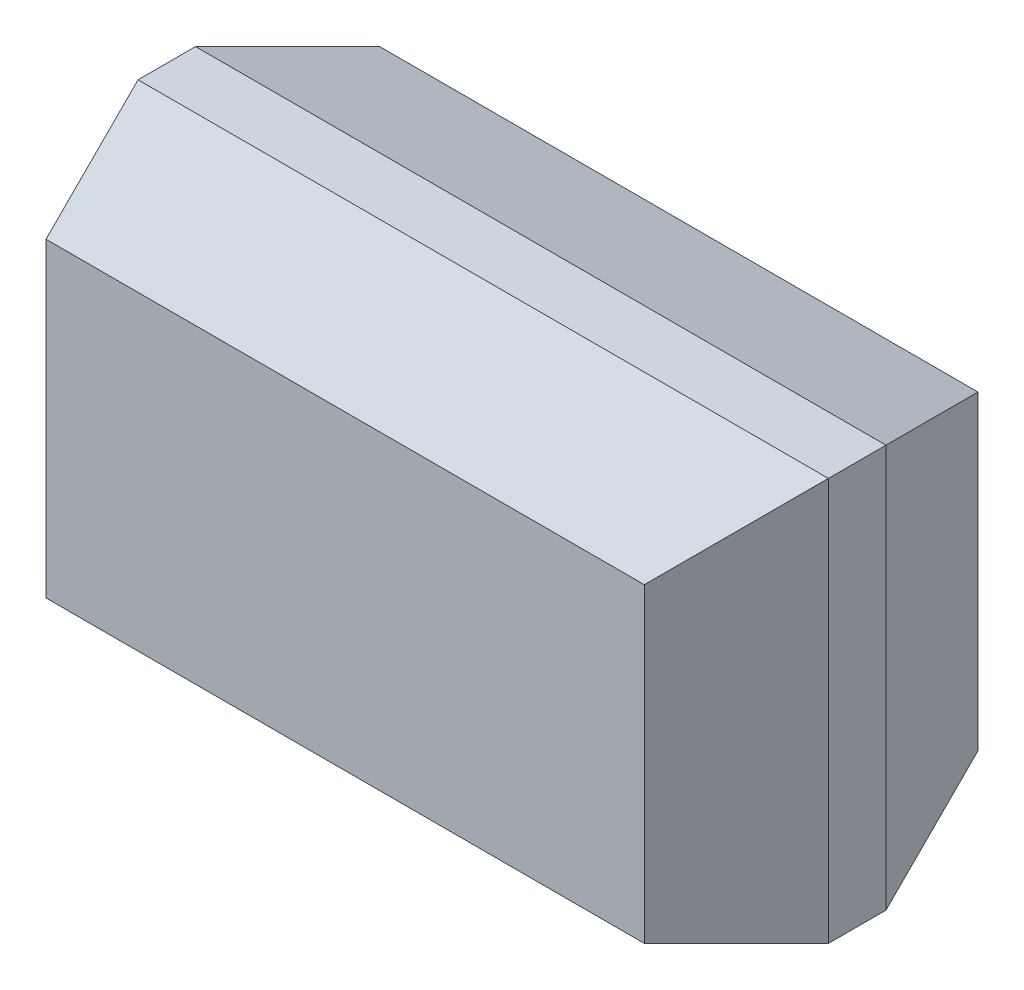
ISO-10303-21;
HEADER;
FILE_DESCRIPTION(('STEP AP214'),'2;1');
FILE_NAME('part.step','',(''),(''),'','','');
FILE_SCHEMA(('AUTOMOTIVE_DESIGN { 1 0 10303 214 1 1 1 1 }'));
ENDSEC;
DATA;
#1=APPLICATION_CONTEXT('core data for automotive mechanical design processes');
#2=APPLICATION_PROTOCOL_DEFINITION('international standard','automotive_design',2000,#1);
#3=PRODUCT_CONTEXT('',#1,'mechanical');
#4=PRODUCT('Part','Part','',(#3));
#5=PRODUCT_RELATED_PRODUCT_CATEGORY('part','',(#4));
#6=PRODUCT_DEFINITION_FORMATION('','',#4);
#7=PRODUCT_DEFINITION_CONTEXT('part definition',#1,'design');
#8=PRODUCT_DEFINITION('design','',#6,#7);
#9=PRODUCT_DEFINITION_SHAPE('','',#8);
#10=(LENGTH_UNIT() NAMED_UNIT(*) SI_UNIT(.MILLI.,.METRE.));
#11=(NAMED_UNIT(*) PLANE_ANGLE_UNIT() SI_UNIT($,.RADIAN.));
#12=(NAMED_UNIT(*) SI_UNIT($,.STERADIAN.) SOLID_ANGLE_UNIT());
#13=UNCERTAINTY_MEASURE_WITH_UNIT(LENGTH_MEASURE(1.E-05),#10,'distance_accuracy_value','');
#14=(GEOMETRIC_REPRESENTATION_CONTEXT(3) GLOBAL_UNCERTAINTY_ASSIGNED_CONTEXT((#13)) GLOBAL_UNIT_ASSIGNED_CONTEXT((#10,
#11,#12)) REPRESENTATION_CONTEXT('',''));
#15=CARTESIAN_POINT('',(0.,0.,0.));
#16=DIRECTION('',(0.,0.,1.));
#17=DIRECTION('',(1.,0.,0.));
#18=AXIS2_PLACEMENT_3D('',#15,#16,#17);
#19=CARTESIAN_POINT('',(0.,0.,1.45));
#20=DIRECTION('',(1.,0.,0.));
#21=DIRECTION('',(0.,0.,-1.));
#22=AXIS2_PLACEMENT_3D('',#19,#20,#21);
#23=PLANE('',#22);
#24=DIRECTION('',(0.,0.,-1.));
#25=VECTOR('',#24,1.);
#26=CARTESIAN_POINT('',(0.,1.75,1.45));
#27=LINE('',#26,#25);
#28=CARTESIAN_POINT('',(0.,1.75,0.849999999999994));
#29=VERTEX_POINT('',#28);
#30=CARTESIAN_POINT('',(0.,1.75,0.600000000000008));
#31=VERTEX_POINT('',#30);
#32=EDGE_CURVE('E173',#29,#31,#27,.T.);
#33=ORIENTED_EDGE('',*,*,#32,.T.);
#34=DIRECTION('',(0.,-1.,0.));
#35=VECTOR('',#34,1.);
#36=CARTESIAN_POINT('',(0.,0.2,0.600000000000007));
#37=LINE('',#36,#35);
#38=CARTESIAN_POINT('',(0.,0.,0.600000000000008));
#39=VERTEX_POINT('',#38);
#40=EDGE_CURVE('E145',#31,#39,#37,.T.);
#41=ORIENTED_EDGE('',*,*,#40,.T.);
#42=DIRECTION('',(0.,0.,-1.));
#43=VECTOR('',#42,1.);
#44=CARTESIAN_POINT('',(0.,0.,1.45));
#45=LINE('',#44,#43);
#46=CARTESIAN_POINT('',(0.,0.,0.849999999999994));
#47=VERTEX_POINT('',#46);
#48=EDGE_CURVE('E118',#47,#39,#45,.T.);
#49=ORIENTED_EDGE('',*,*,#48,.F.);
#50=DIRECTION('',(0.,1.,0.));
#51=VECTOR('',#50,1.);
#52=CARTESIAN_POINT('',(0.,0.,0.849999999999994));
#53=LINE('',#52,#51);
#54=EDGE_CURVE('E151',#47,#29,#53,.T.);
#55=ORIENTED_EDGE('',*,*,#54,.T.);
#56=EDGE_LOOP('',(#33,#41,#49,#55));
#57=FACE_BOUND('',#56,.T.);
#58=ADVANCED_FACE('F30',(#57),#23,.F.);
#59=CARTESIAN_POINT('',(0.,0.,1.45));
#60=DIRECTION('',(0.,1.,0.));
#61=DIRECTION('',(0.,0.,1.));
#62=AXIS2_PLACEMENT_3D('',#59,#60,#61);
#63=PLANE('',#62);
#64=ORIENTED_EDGE('',*,*,#48,.T.);
#65=DIRECTION('',(1.,0.,0.));
#66=VECTOR('',#65,1.);
#67=CARTESIAN_POINT('',(3.,0.,0.600000000000007));
#68=LINE('',#67,#66);
#69=CARTESIAN_POINT('',(3.,0.,0.600000000000008));
#70=VERTEX_POINT('',#69);
#71=EDGE_CURVE('E117',#39,#70,#68,.T.);
#72=ORIENTED_EDGE('',*,*,#71,.T.);
#73=DIRECTION('',(0.,0.,-1.));
#74=VECTOR('',#73,1.);
#75=CARTESIAN_POINT('',(3.,0.,1.45));
#76=LINE('',#75,#74);
#77=CARTESIAN_POINT('',(3.,0.,0.849999999999994));
#78=VERTEX_POINT('',#77);
#79=EDGE_CURVE('E99',#78,#70,#76,.T.);
#80=ORIENTED_EDGE('',*,*,#79,.F.);
#81=DIRECTION('',(-1.,0.,0.));
#82=VECTOR('',#81,1.);
#83=CARTESIAN_POINT('',(0.,0.,0.849999999999994));
#84=LINE('',#83,#82);
#85=EDGE_CURVE('E114',#78,#47,#84,.T.);
#86=ORIENTED_EDGE('',*,*,#85,.T.);
#87=EDGE_LOOP('',(#64,#72,#80,#86));
#88=FACE_BOUND('',#87,.T.);
#89=ADVANCED_FACE('F113',(#88),#63,.F.);
#90=CARTESIAN_POINT('',(3.,0.,1.45));
#91=DIRECTION('',(-1.,0.,0.));
#92=DIRECTION('',(0.,0.,1.));
#93=AXIS2_PLACEMENT_3D('',#90,#91,#92);
#94=PLANE('',#93);
#95=ORIENTED_EDGE('',*,*,#79,.T.);
#96=DIRECTION('',(0.,1.,0.));
#97=VECTOR('',#96,1.);
#98=CARTESIAN_POINT('',(3.,1.55,0.600000000000007));
#99=LINE('',#98,#97);
#100=CARTESIAN_POINT('',(3.,1.75,0.600000000000008));
#101=VERTEX_POINT('',#100);
#102=EDGE_CURVE('E131',#70,#101,#99,.T.);
#103=ORIENTED_EDGE('',*,*,#102,.T.);
#104=DIRECTION('',(0.,0.,-1.));
#105=VECTOR('',#104,1.);
#106=CARTESIAN_POINT('',(3.,1.75,1.45));
#107=LINE('',#106,#105);
#108=CARTESIAN_POINT('',(3.,1.75,0.849999999999994));
#109=VERTEX_POINT('',#108);
#110=EDGE_CURVE('E102',#109,#101,#107,.T.);
#111=ORIENTED_EDGE('',*,*,#110,.F.);
#112=DIRECTION('',(0.,-1.,0.));
#113=VECTOR('',#112,1.);
#114=CARTESIAN_POINT('',(3.,0.,0.849999999999993));
#115=LINE('',#114,#113);
#116=EDGE_CURVE('E95',#109,#78,#115,.T.);
#117=ORIENTED_EDGE('',*,*,#116,.T.);
#118=EDGE_LOOP('',(#95,#103,#111,#117));
#119=FACE_BOUND('',#118,.T.);
#120=ADVANCED_FACE('F97',(#119),#94,.F.);
#121=CARTESIAN_POINT('',(0.,1.75,1.45));
#122=DIRECTION('',(0.,-1.,0.));
#123=DIRECTION('',(0.,0.,-1.));
#124=AXIS2_PLACEMENT_3D('',#121,#122,#123);
#125=PLANE('',#124);
#126=ORIENTED_EDGE('',*,*,#110,.T.);
#127=DIRECTION('',(-1.,0.,0.));
#128=VECTOR('',#127,1.);
#129=CARTESIAN_POINT('',(0.,1.75,0.600000000000007));
#130=LINE('',#129,#128);
#131=EDGE_CURVE('E159',#101,#31,#130,.T.);
#132=ORIENTED_EDGE('',*,*,#131,.T.);
#133=ORIENTED_EDGE('',*,*,#32,.F.);
#134=DIRECTION('',(1.,0.,0.));
#135=VECTOR('',#134,1.);
#136=CARTESIAN_POINT('',(0.,1.75,0.849999999999994));
#137=LINE('',#136,#135);
#138=EDGE_CURVE('E162',#29,#109,#137,.T.);
#139=ORIENTED_EDGE('',*,*,#138,.T.);
#140=EDGE_LOOP('',(#126,#132,#133,#139));
#141=FACE_BOUND('',#140,.T.);
#142=ADVANCED_FACE('F189',(#141),#125,.F.);
#143=CARTESIAN_POINT('',(0.,1.75,1.45));
#144=DIRECTION('',(0.,0.,-1.));
#145=DIRECTION('',(-1.,0.,0.));
#146=AXIS2_PLACEMENT_3D('',#143,#144,#145);
#147=PLANE('',#146);
#148=DIRECTION('',(1.,0.,0.));
#149=VECTOR('',#148,1.);
#150=CARTESIAN_POINT('',(0.,0.2,1.45));
#151=LINE('',#150,#149);
#152=CARTESIAN_POINT('',(0.2,0.2,1.45));
#153=VERTEX_POINT('',#152);
#154=CARTESIAN_POINT('',(2.8,0.2,1.45));
#155=VERTEX_POINT('',#154);
#156=EDGE_CURVE('E125',#153,#155,#151,.T.);
#157=ORIENTED_EDGE('',*,*,#156,.T.);
#158=DIRECTION('',(0.,1.,0.));
#159=VECTOR('',#158,1.);
#160=CARTESIAN_POINT('',(2.8,1.75,1.45));
#161=LINE('',#160,#159);
#162=CARTESIAN_POINT('',(2.8,1.55,1.45));
#163=VERTEX_POINT('',#162);
#164=EDGE_CURVE('E130',#155,#163,#161,.T.);
#165=ORIENTED_EDGE('',*,*,#164,.T.);
#166=DIRECTION('',(-1.,0.,0.));
#167=VECTOR('',#166,1.);
#168=CARTESIAN_POINT('',(0.,1.55,1.45));
#169=LINE('',#168,#167);
#170=CARTESIAN_POINT('',(0.2,1.55,1.45));
#171=VERTEX_POINT('',#170);
#172=EDGE_CURVE('E165',#163,#171,#169,.T.);
#173=ORIENTED_EDGE('',*,*,#172,.T.);
#174=DIRECTION('',(0.,-1.,0.));
#175=VECTOR('',#174,1.);
#176=CARTESIAN_POINT('',(0.2,1.75,1.45));
#177=LINE('',#176,#175);
#178=EDGE_CURVE('E154',#171,#153,#177,.T.);
#179=ORIENTED_EDGE('',*,*,#178,.T.);
#180=EDGE_LOOP('',(#157,#165,#173,#179));
#181=FACE_BOUND('',#180,.T.);
#182=ADVANCED_FACE('F193',(#181),#147,.F.);
#183=CARTESIAN_POINT('',(0.,1.75,0.));
#184=DIRECTION('',(0.,0.,-1.));
#185=DIRECTION('',(-1.,0.,0.));
#186=AXIS2_PLACEMENT_3D('',#183,#184,#185);
#187=PLANE('',#186);
#188=DIRECTION('',(1.,0.,0.));
#189=VECTOR('',#188,1.);
#190=CARTESIAN_POINT('',(3.,1.55,0.));
#191=LINE('',#190,#189);
#192=CARTESIAN_POINT('',(0.2,1.55,0.));
#193=VERTEX_POINT('',#192);
#194=CARTESIAN_POINT('',(2.8,1.55,0.));
#195=VERTEX_POINT('',#194);
#196=EDGE_CURVE('E157',#193,#195,#191,.T.);
#197=ORIENTED_EDGE('',*,*,#196,.T.);
#198=DIRECTION('',(0.,-1.,0.));
#199=VECTOR('',#198,1.);
#200=CARTESIAN_POINT('',(2.8,0.2,0.));
#201=LINE('',#200,#199);
#202=CARTESIAN_POINT('',(2.8,0.2,0.));
#203=VERTEX_POINT('',#202);
#204=EDGE_CURVE('E38',#195,#203,#201,.T.);
#205=ORIENTED_EDGE('',*,*,#204,.T.);
#206=DIRECTION('',(-1.,0.,0.));
#207=VECTOR('',#206,1.);
#208=CARTESIAN_POINT('',(0.,0.2,0.));
#209=LINE('',#208,#207);
#210=CARTESIAN_POINT('',(0.2,0.2,0.));
#211=VERTEX_POINT('',#210);
#212=EDGE_CURVE('E167',#203,#211,#209,.T.);
#213=ORIENTED_EDGE('',*,*,#212,.T.);
#214=DIRECTION('',(0.,1.,0.));
#215=VECTOR('',#214,1.);
#216=CARTESIAN_POINT('',(0.2,1.55,0.));
#217=LINE('',#216,#215);
#218=EDGE_CURVE('E140',#211,#193,#217,.T.);
#219=ORIENTED_EDGE('',*,*,#218,.T.);
#220=EDGE_LOOP('',(#197,#205,#213,#219));
#221=FACE_BOUND('',#220,.T.);
#222=ADVANCED_FACE('F191',(#221),#187,.T.);
#223=CARTESIAN_POINT('',(0.,0.2,1.45));
#224=DIRECTION('',(0.,0.948683298050515,-0.316227766016835));
#225=DIRECTION('',(0.,0.316227766016835,0.948683298050515));
#226=AXIS2_PLACEMENT_3D('',#223,#224,#225);
#227=PLANE('',#226);
#228=ORIENTED_EDGE('',*,*,#85,.F.);
#229=DIRECTION('',(-0.301511344577761,0.301511344577761,0.904534033733292));
#230=VECTOR('',#229,1.);
#231=CARTESIAN_POINT('',(2.54545454545455,0.454545454545451,2.21363636363636));
#232=LINE('',#231,#230);
#233=EDGE_CURVE('E105',#78,#155,#232,.T.);
#234=ORIENTED_EDGE('',*,*,#233,.T.);
#235=ORIENTED_EDGE('',*,*,#156,.F.);
#236=DIRECTION('',(-0.301511344577761,-0.301511344577761,-0.904534033733292));
#237=VECTOR('',#236,1.);
#238=CARTESIAN_POINT('',(0.181818181818182,0.181818181818182,1.39545454545455));
#239=LINE('',#238,#237);
#240=EDGE_CURVE('E124',#153,#47,#239,.T.);
#241=ORIENTED_EDGE('',*,*,#240,.T.);
#242=EDGE_LOOP('',(#228,#234,#235,#241));
#243=FACE_BOUND('',#242,.T.);
#244=ADVANCED_FACE('F121',(#243),#227,.F.);
#245=CARTESIAN_POINT('',(0.,0.,0.600000000000007));
#246=DIRECTION('',(0.,-0.948683298050515,-0.316227766016835));
#247=DIRECTION('',(0.,0.316227766016835,-0.948683298050515));
#248=AXIS2_PLACEMENT_3D('',#245,#246,#247);
#249=PLANE('',#248);
#250=ORIENTED_EDGE('',*,*,#212,.F.);
#251=DIRECTION('',(0.301511344577761,-0.301511344577761,0.904534033733292));
#252=VECTOR('',#251,1.);
#253=CARTESIAN_POINT('',(2.72727272727273,0.272727272727269,-0.218181818181807));
#254=LINE('',#253,#252);
#255=EDGE_CURVE('E11',#203,#70,#254,.T.);
#256=ORIENTED_EDGE('',*,*,#255,.T.);
#257=ORIENTED_EDGE('',*,*,#71,.F.);
#258=DIRECTION('',(0.301511344577761,0.301511344577761,-0.904534033733292));
#259=VECTOR('',#258,1.);
#260=CARTESIAN_POINT('',(0.,0.,0.600000000000007));
#261=LINE('',#260,#259);
#262=EDGE_CURVE('E142',#39,#211,#261,.T.);
#263=ORIENTED_EDGE('',*,*,#262,.T.);
#264=EDGE_LOOP('',(#250,#256,#257,#263));
#265=FACE_BOUND('',#264,.T.);
#266=ADVANCED_FACE('F186',(#265),#249,.T.);
#267=CARTESIAN_POINT('',(0.,1.55,1.45));
#268=DIRECTION('',(0.,-0.948683298050515,-0.316227766016835));
#269=DIRECTION('',(0.,0.316227766016835,-0.948683298050515));
#270=AXIS2_PLACEMENT_3D('',#267,#268,#269);
#271=PLANE('',#270);
#272=ORIENTED_EDGE('',*,*,#172,.F.);
#273=DIRECTION('',(0.301511344577761,0.301511344577761,-0.904534033733292));
#274=VECTOR('',#273,1.);
#275=CARTESIAN_POINT('',(2.54545454545455,1.29545454545455,2.21363636363636));
#276=LINE('',#275,#274);
#277=EDGE_CURVE('E106',#163,#109,#276,.T.);
#278=ORIENTED_EDGE('',*,*,#277,.T.);
#279=ORIENTED_EDGE('',*,*,#138,.F.);
#280=DIRECTION('',(0.301511344577761,-0.301511344577761,0.904534033733292));
#281=VECTOR('',#280,1.);
#282=CARTESIAN_POINT('',(0.181818181818182,1.56818181818182,1.39545454545455));
#283=LINE('',#282,#281);
#284=EDGE_CURVE('E148',#29,#171,#283,.T.);
#285=ORIENTED_EDGE('',*,*,#284,.T.);
#286=EDGE_LOOP('',(#272,#278,#279,#285));
#287=FACE_BOUND('',#286,.T.);
#288=ADVANCED_FACE('F213',(#287),#271,.F.);
#289=CARTESIAN_POINT('',(0.,1.75,0.600000000000007));
#290=DIRECTION('',(0.,0.948683298050515,-0.316227766016835));
#291=DIRECTION('',(0.,0.316227766016835,0.948683298050515));
#292=AXIS2_PLACEMENT_3D('',#289,#290,#291);
#293=PLANE('',#292);
#294=ORIENTED_EDGE('',*,*,#131,.F.);
#295=DIRECTION('',(-0.301511344577761,-0.301511344577761,-0.904534033733292));
#296=VECTOR('',#295,1.);
#297=CARTESIAN_POINT('',(2.72727272727273,1.47727272727273,-0.218181818181807));
#298=LINE('',#297,#296);
#299=EDGE_CURVE('E52',#101,#195,#298,.T.);
#300=ORIENTED_EDGE('',*,*,#299,.T.);
#301=ORIENTED_EDGE('',*,*,#196,.F.);
#302=DIRECTION('',(-0.301511344577761,0.301511344577761,0.904534033733292));
#303=VECTOR('',#302,1.);
#304=CARTESIAN_POINT('',(0.,1.75,0.600000000000007));
#305=LINE('',#304,#303);
#306=EDGE_CURVE('E138',#193,#31,#305,.T.);
#307=ORIENTED_EDGE('',*,*,#306,.T.);
#308=EDGE_LOOP('',(#294,#300,#301,#307));
#309=FACE_BOUND('',#308,.T.);
#310=ADVANCED_FACE('F190',(#309),#293,.T.);
#311=CARTESIAN_POINT('',(0.2,1.75,1.45));
#312=DIRECTION('',(0.948683298050515,0.,-0.316227766016835));
#313=DIRECTION('',(-0.316227766016835,0.,-0.948683298050515));
#314=AXIS2_PLACEMENT_3D('',#311,#312,#313);
#315=PLANE('',#314);
#316=ORIENTED_EDGE('',*,*,#284,.F.);
#317=ORIENTED_EDGE('',*,*,#54,.F.);
#318=ORIENTED_EDGE('',*,*,#240,.F.);
#319=ORIENTED_EDGE('',*,*,#178,.F.);
#320=EDGE_LOOP('',(#316,#317,#318,#319));
#321=FACE_BOUND('',#320,.T.);
#322=ADVANCED_FACE('F219',(#321),#315,.F.);
#323=CARTESIAN_POINT('',(0.,0.,0.600000000000007));
#324=DIRECTION('',(-0.948683298050515,0.,-0.316227766016835));
#325=DIRECTION('',(-0.316227766016835,0.,0.948683298050515));
#326=AXIS2_PLACEMENT_3D('',#323,#324,#325);
#327=PLANE('',#326);
#328=ORIENTED_EDGE('',*,*,#306,.F.);
#329=ORIENTED_EDGE('',*,*,#218,.F.);
#330=ORIENTED_EDGE('',*,*,#262,.F.);
#331=ORIENTED_EDGE('',*,*,#40,.F.);
#332=EDGE_LOOP('',(#328,#329,#330,#331));
#333=FACE_BOUND('',#332,.T.);
#334=ADVANCED_FACE('F183',(#333),#327,.T.);
#335=CARTESIAN_POINT('',(2.8,1.75,1.45));
#336=DIRECTION('',(-0.948683298050515,0.,-0.316227766016835));
#337=DIRECTION('',(-0.316227766016835,0.,0.948683298050515));
#338=AXIS2_PLACEMENT_3D('',#335,#336,#337);
#339=PLANE('',#338);
#340=ORIENTED_EDGE('',*,*,#233,.F.);
#341=ORIENTED_EDGE('',*,*,#116,.F.);
#342=ORIENTED_EDGE('',*,*,#277,.F.);
#343=ORIENTED_EDGE('',*,*,#164,.F.);
#344=EDGE_LOOP('',(#340,#341,#342,#343));
#345=FACE_BOUND('',#344,.T.);
#346=ADVANCED_FACE('F128',(#345),#339,.F.);
#347=CARTESIAN_POINT('',(3.,0.,0.600000000000007));
#348=DIRECTION('',(0.948683298050515,0.,-0.316227766016835));
#349=DIRECTION('',(-0.316227766016835,0.,-0.948683298050515));
#350=AXIS2_PLACEMENT_3D('',#347,#348,#349);
#351=PLANE('',#350);
#352=ORIENTED_EDGE('',*,*,#255,.F.);
#353=ORIENTED_EDGE('',*,*,#204,.F.);
#354=ORIENTED_EDGE('',*,*,#299,.F.);
#355=ORIENTED_EDGE('',*,*,#102,.F.);
#356=EDGE_LOOP('',(#352,#353,#354,#355));
#357=FACE_BOUND('',#356,.T.);
#358=ADVANCED_FACE('F32',(#357),#351,.T.);
#359=CLOSED_SHELL('',(#58,#89,#120,#142,#182,#222,#244,#266,#288,#310,#322,#334,#346,#358));
#360=MANIFOLD_SOLID_BREP('B2',#359);
#361=ADVANCED_BREP_SHAPE_REPRESENTATION('',(#18,#360),#14);
#362=SHAPE_DEFINITION_REPRESENTATION(#9,#361);
ENDSEC;
END-ISO-10303-21;
